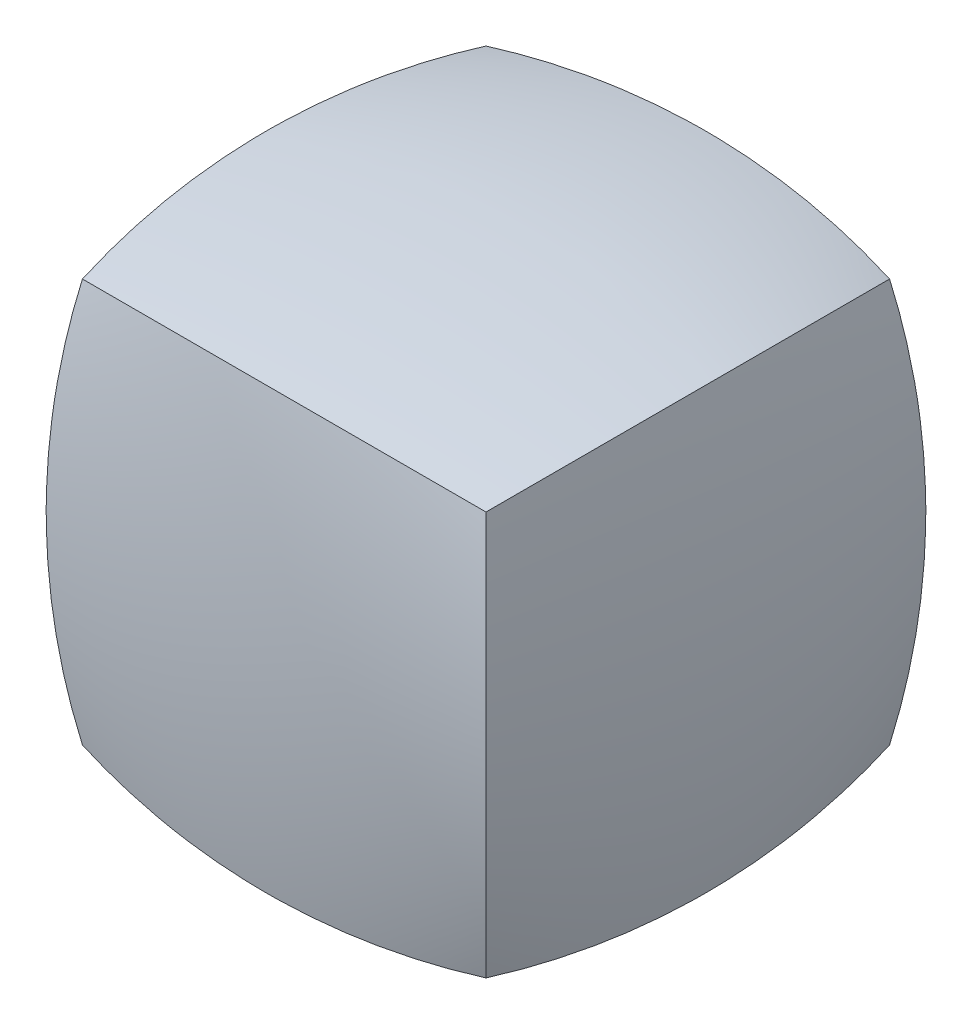
ISO-10303-21;
HEADER;
FILE_DESCRIPTION(('STEP AP214'),'2;1');
FILE_NAME('part.step','',(''),(''),'','','');
FILE_SCHEMA(('AUTOMOTIVE_DESIGN { 1 0 10303 214 1 1 1 1 }'));
ENDSEC;
DATA;
#1=APPLICATION_CONTEXT('core data for automotive mechanical design processes');
#2=APPLICATION_PROTOCOL_DEFINITION('international standard','automotive_design',2000,#1);
#3=PRODUCT_CONTEXT('',#1,'mechanical');
#4=PRODUCT('Part','Part','',(#3));
#5=PRODUCT_RELATED_PRODUCT_CATEGORY('part','',(#4));
#6=PRODUCT_DEFINITION_FORMATION('','',#4);
#7=PRODUCT_DEFINITION_CONTEXT('part definition',#1,'design');
#8=PRODUCT_DEFINITION('design','',#6,#7);
#9=PRODUCT_DEFINITION_SHAPE('','',#8);
#10=(LENGTH_UNIT() NAMED_UNIT(*) SI_UNIT(.MILLI.,.METRE.));
#11=(NAMED_UNIT(*) PLANE_ANGLE_UNIT() SI_UNIT($,.RADIAN.));
#12=(NAMED_UNIT(*) SI_UNIT($,.STERADIAN.) SOLID_ANGLE_UNIT());
#13=UNCERTAINTY_MEASURE_WITH_UNIT(LENGTH_MEASURE(1.E-05),#10,'distance_accuracy_value','');
#14=(GEOMETRIC_REPRESENTATION_CONTEXT(3) GLOBAL_UNCERTAINTY_ASSIGNED_CONTEXT((#13)) GLOBAL_UNIT_ASSIGNED_CONTEXT((#10,
#11,#12)) REPRESENTATION_CONTEXT('',''));
#15=CARTESIAN_POINT('',(0.,0.,0.));
#16=DIRECTION('',(0.,0.,1.));
#17=DIRECTION('',(1.,0.,0.));
#18=AXIS2_PLACEMENT_3D('',#15,#16,#17);
#19=CARTESIAN_POINT('',(12.7000000000001,-12.6999999999999,-12.7));
#20=CARTESIAN_POINT('',(4.37004205779716,-14.2208352893379,-14.220835289338));
#21=CARTESIAN_POINT('',(-4.37004205779696,-14.2208352893379,-14.2208352893381));
#22=CARTESIAN_POINT('',(-12.6999999999999,-12.6999999999999,-12.7000000000001));
#23=CARTESIAN_POINT('',(14.220835289338,-14.220835289338,-4.37004205779701));
#24=CARTESIAN_POINT('',(4.87698715424311,-15.7416705786759,-4.87698715424311));
#25=CARTESIAN_POINT('',(-4.87698715424297,-15.7416705786759,-4.87698715424316));
#26=CARTESIAN_POINT('',(-14.2208352893379,-14.2208352893379,-4.3700420577972));
#27=CARTESIAN_POINT('',(14.2208352893379,-14.220835289338,4.37004205779711));
#28=CARTESIAN_POINT('',(4.87698715424307,-15.741670578676,4.87698715424294));
#29=CARTESIAN_POINT('',(-4.87698715424301,-15.741670578676,4.87698715424291));
#30=CARTESIAN_POINT('',(-14.2208352893379,-14.220835289338,4.37004205779691));
#31=CARTESIAN_POINT('',(12.6999999999998,-12.7000000000001,12.7000000000001));
#32=CARTESIAN_POINT('',(4.37004205779706,-14.2208352893381,14.2208352893378));
#33=CARTESIAN_POINT('',(-4.37004205779705,-14.2208352893381,14.2208352893378));
#34=CARTESIAN_POINT('',(-12.7,-12.7000000000001,12.6999999999999));
#35=B_SPLINE_SURFACE_WITH_KNOTS('',3,3,((#19,#20,#21,#22),(#23,#24,#25,#26),(#27,#28,#29,#30),
(#31,#32,#33,#34)),.UNSPECIFIED.,.F.,.F.,.F.,(4,4),(4,4),(0.,1.),(0.,1.),.UNSPECIFIED.);
#36=CARTESIAN_POINT('',(12.7,-12.7000000000001,12.6999999999999));
#37=CARTESIAN_POINT('',(12.808163142103,-12.8081631421031,12.1075659462186));
#38=CARTESIAN_POINT('',(12.9087486818566,-12.9087486818567,11.5124219256881));
#39=CARTESIAN_POINT('',(13.0946543970654,-13.0946543970655,10.3173885807694));
#40=CARTESIAN_POINT('',(13.1799746742148,-13.1799746742148,9.71749928802119));
#41=CARTESIAN_POINT('',(13.4128119976239,-13.412811997624,7.91219725853617));
#42=CARTESIAN_POINT('',(13.5372926293325,-13.5372926293325,6.70067319721369));
#43=CARTESIAN_POINT('',(13.7240803205732,-13.7240803205732,4.26817611667957));
#44=CARTESIAN_POINT('',(13.7863855916014,-13.7863855916014,3.04720282667438));
#45=CARTESIAN_POINT('',(13.8485223656913,-13.8485223656913,0.601763003725304));
#46=CARTESIAN_POINT('',(13.8483423856396,-13.8483423856396,-0.622704129947835));
#47=CARTESIAN_POINT('',(13.7934098673822,-13.7934098673823,-2.76017821279836));
#48=CARTESIAN_POINT('',(13.7524154945921,-13.7524154945921,-3.67394558271152));
#49=CARTESIAN_POINT('',(13.6355722104236,-13.6355722104236,-5.49716768806743));
#50=CARTESIAN_POINT('',(13.5597188051603,-13.5597188051603,-6.4066218521921));
#51=CARTESIAN_POINT('',(13.3732652826263,-13.3732652826263,-8.21937943516999));
#52=CARTESIAN_POINT('',(13.262627469886,-13.262627469886,-9.12267508995592));
#53=CARTESIAN_POINT('',(13.0069934203018,-13.0069934203018,-10.9193811690343));
#54=CARTESIAN_POINT('',(12.8620011501779,-12.8620011501779,-11.812792722133));
#55=CARTESIAN_POINT('',(12.6999999999999,-12.6999999999999,-12.7000000000001));
#56=B_SPLINE_CURVE_WITH_KNOTS('',3,(#36,#37,#38,#39,#40,#41,#42,#43,#44,#45,#46,#47,#48,#49,#50,
#51,#52,#53,#54,#55),.UNSPECIFIED.,.F.,.F.,(4,2,2,2,2,2,2,2,2,4),(0.,1.83537962622689,
3.67074702506192,7.34000686795346,11.0093722558164,14.6794119749915,17.4249742189888,
20.1708905090602,22.9197928345178,25.668377913908),.UNSPECIFIED.);
#57=CARTESIAN_POINT('',(12.7000000000001,-12.6999999999999,12.7));
#58=VERTEX_POINT('',#57);
#59=CARTESIAN_POINT('',(12.7000000000001,-12.6999999999999,-12.7));
#60=VERTEX_POINT('',#59);
#61=EDGE_CURVE('E126',#58,#60,#56,.T.);
#62=CARTESIAN_POINT('',(12.6999999999998,-12.7000000000001,12.7000000000001));
#63=CARTESIAN_POINT('',(12.1075659462185,-12.8081631421031,12.808163142103));
#64=CARTESIAN_POINT('',(11.512421925688,-12.9087486818568,12.9087486818566));
#65=CARTESIAN_POINT('',(10.3173885807694,-13.0946543970656,13.0946543970653));
#66=CARTESIAN_POINT('',(9.71749928802112,-13.1799746742149,13.1799746742147));
#67=CARTESIAN_POINT('',(7.91219725853611,-13.4128119976241,13.4128119976239));
#68=CARTESIAN_POINT('',(6.70067319721363,-13.5372926293326,13.5372926293325));
#69=CARTESIAN_POINT('',(4.2681761166795,-13.7240803205733,13.7240803205731));
#70=CARTESIAN_POINT('',(3.04720282667431,-13.7863855916015,13.7863855916013));
#71=CARTESIAN_POINT('',(0.601763003725235,-13.8485223656914,13.8485223656912));
#72=CARTESIAN_POINT('',(-0.622704129947903,-13.8483423856397,13.8483423856395));
#73=CARTESIAN_POINT('',(-2.76017821279841,-13.7934098673824,13.7934098673822));
#74=CARTESIAN_POINT('',(-3.67394558271155,-13.7524154945922,13.752415494592));
#75=CARTESIAN_POINT('',(-5.49716768806742,-13.6355722104237,13.6355722104235));
#76=CARTESIAN_POINT('',(-6.40662185219208,-13.5597188051604,13.5597188051602));
#77=CARTESIAN_POINT('',(-8.21937943516994,-13.3732652826265,13.3732652826262));
#78=CARTESIAN_POINT('',(-9.12267508995585,-13.2626274698862,13.2626274698859));
#79=CARTESIAN_POINT('',(-10.9193811690342,-13.006993420302,13.0069934203018));
#80=CARTESIAN_POINT('',(-11.8127927221329,-12.8620011501781,12.8620011501779));
#81=CARTESIAN_POINT('',(-12.7,-12.7000000000001,12.6999999999999));
#82=B_SPLINE_CURVE_WITH_KNOTS('',3,(#62,#63,#64,#65,#66,#67,#68,#69,#70,#71,#72,#73,#74,#75,#76,
#77,#78,#79,#80,#81),.UNSPECIFIED.,.F.,.F.,(4,2,2,2,2,2,2,2,2,4),(0.,1.83537962622689,
3.67074702506192,7.34000686795347,11.0093722558164,14.6794119749915,17.4249742189888,
20.1708905090602,22.9197928345177,25.6683779139079),.UNSPECIFIED.);
#83=CARTESIAN_POINT('',(-12.7,-12.7000000000001,12.6999999999999));
#84=VERTEX_POINT('',#83);
#85=EDGE_CURVE('E116',#58,#84,#82,.T.);
#86=CARTESIAN_POINT('',(-12.7000000000001,-12.7000000000001,-12.6999999999998));
#87=CARTESIAN_POINT('',(-12.8081631421031,-12.8081631421031,-12.1075659462185));
#88=CARTESIAN_POINT('',(-12.9087486818567,-12.9087486818567,-11.512421925688));
#89=CARTESIAN_POINT('',(-13.0946543970655,-13.0946543970655,-10.3173885807694));
#90=CARTESIAN_POINT('',(-13.1799746742148,-13.1799746742148,-9.7174992880211));
#91=CARTESIAN_POINT('',(-13.412811997624,-13.412811997624,-7.91219725853608));
#92=CARTESIAN_POINT('',(-13.5372926293325,-13.5372926293325,-6.7006731972136));
#93=CARTESIAN_POINT('',(-13.7240803205732,-13.7240803205732,-4.26817611667947));
#94=CARTESIAN_POINT('',(-13.7863855916014,-13.7863855916014,-3.04720282667428));
#95=CARTESIAN_POINT('',(-13.8485223656913,-13.8485223656913,-0.601763003725207));
#96=CARTESIAN_POINT('',(-13.8483423856396,-13.8483423856396,0.622704129947932));
#97=CARTESIAN_POINT('',(-13.7934098673822,-13.7934098673823,2.76017821279846));
#98=CARTESIAN_POINT('',(-13.752415494592,-13.7524154945921,3.67394558271161));
#99=CARTESIAN_POINT('',(-13.6355722104235,-13.6355722104236,5.49716768806752));
#100=CARTESIAN_POINT('',(-13.5597188051602,-13.5597188051603,6.40662185219219));
#101=CARTESIAN_POINT('',(-13.3732652826263,-13.3732652826263,8.21937943517008));
#102=CARTESIAN_POINT('',(-13.2626274698859,-13.262627469886,9.12267508995601));
#103=CARTESIAN_POINT('',(-13.0069934203018,-13.0069934203018,10.9193811690344));
#104=CARTESIAN_POINT('',(-12.8620011501779,-12.8620011501779,11.8127927221331));
#105=CARTESIAN_POINT('',(-12.6999999999998,-12.6999999999999,12.7000000000002));
#106=B_SPLINE_CURVE_WITH_KNOTS('',3,(#86,#87,#88,#89,#90,#91,#92,#93,#94,#95,#96,#97,#98,#99,
#100,#101,#102,#103,#104,#105),.UNSPECIFIED.,.F.,.F.,(4,2,2,2,2,2,2,2,2,4),(0.,1.83537962622689,
3.67074702506192,7.34000686795346,11.0093722558164,14.6794119749915,17.4249742189888,
20.1708905090602,22.9197928345178,25.6683779139081),.UNSPECIFIED.);
#107=CARTESIAN_POINT('',(-12.7000000000001,-12.7000000000001,-12.6999999999998));
#108=VERTEX_POINT('',#107);
#109=EDGE_CURVE('E13',#108,#84,#106,.T.);
#110=CARTESIAN_POINT('',(-12.6999999999999,-12.6999999999999,-12.7000000000001));
#111=CARTESIAN_POINT('',(-12.1075659462186,-12.8081631421029,-12.8081631421031));
#112=CARTESIAN_POINT('',(-11.5124219256881,-12.9087486818566,-12.9087486818568));
#113=CARTESIAN_POINT('',(-10.3173885807695,-13.0946543970654,-13.0946543970656));
#114=CARTESIAN_POINT('',(-9.71749928802124,-13.1799746742147,-13.1799746742149));
#115=CARTESIAN_POINT('',(-7.91219725853622,-13.4128119976239,-13.4128119976241));
#116=CARTESIAN_POINT('',(-6.70067319721374,-13.5372926293324,-13.5372926293326));
#117=CARTESIAN_POINT('',(-4.26817611667962,-13.7240803205731,-13.7240803205733));
#118=CARTESIAN_POINT('',(-3.04720282667443,-13.7863855916013,-13.7863855916014));
#119=CARTESIAN_POINT('',(-0.601763003725352,-13.8485223656912,-13.8485223656914));
#120=CARTESIAN_POINT('',(0.622704129947787,-13.8483423856395,-13.8483423856396));
#121=CARTESIAN_POINT('',(2.76017821279831,-13.7934098673822,-13.7934098673823));
#122=CARTESIAN_POINT('',(3.67394558271147,-13.752415494592,-13.7524154945921));
#123=CARTESIAN_POINT('',(5.49716768806738,-13.6355722104236,-13.6355722104237));
#124=CARTESIAN_POINT('',(6.40662185219205,-13.5597188051603,-13.5597188051604));
#125=CARTESIAN_POINT('',(8.21937943516994,-13.3732652826263,-13.3732652826264));
#126=CARTESIAN_POINT('',(9.12267508995587,-13.262627469886,-13.2626274698861));
#127=CARTESIAN_POINT('',(10.9193811690342,-13.0069934203018,-13.0069934203019));
#128=CARTESIAN_POINT('',(11.812792722133,-12.8620011501779,-12.862001150178));
#129=CARTESIAN_POINT('',(12.7000000000001,-12.6999999999999,-12.7));
#130=B_SPLINE_CURVE_WITH_KNOTS('',3,(#110,#111,#112,#113,#114,#115,#116,#117,#118,#119,#120,
#121,#122,#123,#124,#125,#126,#127,#128,#129),.UNSPECIFIED.,.F.,.F.,(4,2,2,2,2,2,2,2,2,4),(0.,
1.83537962622689,3.67074702506192,7.34000686795346,11.0093722558164,14.6794119749915,
17.4249742189888,20.1708905090602,22.9197928345178,25.6683779139081),.UNSPECIFIED.);
#131=EDGE_CURVE('E123',#108,#60,#130,.T.);
#132=ORIENTED_EDGE('',*,*,#61,.F.);
#133=ORIENTED_EDGE('',*,*,#85,.T.);
#134=ORIENTED_EDGE('',*,*,#109,.F.);
#135=ORIENTED_EDGE('',*,*,#131,.T.);
#136=EDGE_LOOP('',(#132,#133,#134,#135));
#137=FACE_BOUND('',#136,.T.);
#138=ADVANCED_FACE('F67',(#137),#35,.T.);
#139=CARTESIAN_POINT('',(12.7000000000001,12.7,12.6999999999999));
#140=CARTESIAN_POINT('',(4.37004205779716,14.220835289338,14.2208352893379));
#141=CARTESIAN_POINT('',(-4.37004205779696,14.220835289338,14.220835289338));
#142=CARTESIAN_POINT('',(-12.6999999999999,12.7,12.7));
#143=CARTESIAN_POINT('',(14.220835289338,14.220835289338,4.37004205779691));
#144=CARTESIAN_POINT('',(4.87698715424311,15.7416705786759,4.876987154243));
#145=CARTESIAN_POINT('',(-4.87698715424297,15.7416705786759,4.87698715424305));
#146=CARTESIAN_POINT('',(-14.2208352893379,14.220835289338,4.3700420577971));
#147=CARTESIAN_POINT('',(14.2208352893379,14.220835289338,-4.37004205779721));
#148=CARTESIAN_POINT('',(4.87698715424307,15.7416705786759,-4.87698715424305));
#149=CARTESIAN_POINT('',(-4.87698715424301,15.7416705786759,-4.87698715424302));
#150=CARTESIAN_POINT('',(-14.2208352893379,14.220835289338,-4.37004205779701));
#151=CARTESIAN_POINT('',(12.6999999999998,12.7,-12.7000000000001));
#152=CARTESIAN_POINT('',(4.37004205779706,14.220835289338,-14.2208352893379));
#153=CARTESIAN_POINT('',(-4.37004205779705,14.220835289338,-14.2208352893379));
#154=CARTESIAN_POINT('',(-12.7,12.7,-12.7));
#155=B_SPLINE_SURFACE_WITH_KNOTS('',3,3,((#139,#140,#141,#142),(#143,#144,#145,#146),(#147,#148,
#149,#150),(#151,#152,#153,#154)),.UNSPECIFIED.,.F.,.F.,.F.,(4,4),(4,4),(0.,1.),(0.,1.),.UNSPECIFIED.);
#156=CARTESIAN_POINT('',(12.7,12.7000000000001,-12.6999999999999));
#157=CARTESIAN_POINT('',(12.808163142103,12.808163142103,-12.1075659462186));
#158=CARTESIAN_POINT('',(12.9087486818567,12.9087486818566,-11.5124219256881));
#159=CARTESIAN_POINT('',(13.0946543970655,13.0946543970654,-10.3173885807694));
#160=CARTESIAN_POINT('',(13.1799746742148,13.1799746742147,-9.71749928802117));
#161=CARTESIAN_POINT('',(13.412811997624,13.4128119976239,-7.91219725853615));
#162=CARTESIAN_POINT('',(13.5372926293325,13.5372926293325,-6.70067319721368));
#163=CARTESIAN_POINT('',(13.7240803205732,13.7240803205732,-4.26817611667955));
#164=CARTESIAN_POINT('',(13.7863855916014,13.7863855916013,-3.04720282667436));
#165=CARTESIAN_POINT('',(13.8485223656914,13.8485223656912,-0.601763003725283));
#166=CARTESIAN_POINT('',(13.8483423856397,13.8483423856395,0.622704129947855));
#167=CARTESIAN_POINT('',(13.7934098673823,13.7934098673822,2.76017821279836));
#168=CARTESIAN_POINT('',(13.7524154945922,13.752415494592,3.6739455827115));
#169=CARTESIAN_POINT('',(13.6355722104237,13.6355722104235,5.49716768806738));
#170=CARTESIAN_POINT('',(13.5597188051604,13.5597188051602,6.40662185219203));
#171=CARTESIAN_POINT('',(13.3732652826265,13.3732652826263,8.21937943516989));
#172=CARTESIAN_POINT('',(13.2626274698862,13.262627469886,9.12267508995581));
#173=CARTESIAN_POINT('',(13.006993420302,13.0069934203018,10.9193811690341));
#174=CARTESIAN_POINT('',(12.8620011501781,12.8620011501779,11.8127927221329));
#175=CARTESIAN_POINT('',(12.7000000000001,12.6999999999999,12.7));
#176=B_SPLINE_CURVE_WITH_KNOTS('',3,(#156,#157,#158,#159,#160,#161,#162,#163,#164,#165,#166,
#167,#168,#169,#170,#171,#172,#173,#174,#175),.UNSPECIFIED.,.F.,.F.,(4,2,2,2,2,2,2,2,2,4),(0.,
1.83537962622689,3.67074702506193,7.34000686795347,11.0093722558164,14.6794119749915,
17.4249742189888,20.1708905090602,22.9197928345177,25.6683779139079),.UNSPECIFIED.);
#177=CARTESIAN_POINT('',(12.7000000000001,12.7,-12.6999999999999));
#178=VERTEX_POINT('',#177);
#179=CARTESIAN_POINT('',(12.6999999999998,12.7000000000001,12.7000000000001));
#180=VERTEX_POINT('',#179);
#181=EDGE_CURVE('E130',#178,#180,#176,.T.);
#182=CARTESIAN_POINT('',(12.6999999999998,12.7,-12.7000000000002));
#183=CARTESIAN_POINT('',(12.1075659462185,12.808163142103,-12.8081631421031));
#184=CARTESIAN_POINT('',(11.512421925688,12.9087486818567,-12.9087486818567));
#185=CARTESIAN_POINT('',(10.3173885807694,13.0946543970655,-13.0946543970654));
#186=CARTESIAN_POINT('',(9.71749928802112,13.1799746742148,-13.1799746742147));
#187=CARTESIAN_POINT('',(7.91219725853611,13.412811997624,-13.412811997624));
#188=CARTESIAN_POINT('',(6.70067319721363,13.5372926293325,-13.5372926293326));
#189=CARTESIAN_POINT('',(4.2681761166795,13.7240803205732,-13.7240803205732));
#190=CARTESIAN_POINT('',(3.04720282667431,13.7863855916014,-13.7863855916014));
#191=CARTESIAN_POINT('',(0.601763003725235,13.8485223656913,-13.8485223656913));
#192=CARTESIAN_POINT('',(-0.622704129947903,13.8483423856396,-13.8483423856396));
#193=CARTESIAN_POINT('',(-2.76017821279841,13.7934098673823,-13.7934098673822));
#194=CARTESIAN_POINT('',(-3.67394558271155,13.7524154945921,-13.7524154945921));
#195=CARTESIAN_POINT('',(-5.49716768806742,13.6355722104236,-13.6355722104236));
#196=CARTESIAN_POINT('',(-6.40662185219208,13.5597188051603,-13.5597188051603));
#197=CARTESIAN_POINT('',(-8.21937943516994,13.3732652826264,-13.3732652826263));
#198=CARTESIAN_POINT('',(-9.12267508995585,13.2626274698861,-13.262627469886));
#199=CARTESIAN_POINT('',(-10.9193811690342,13.0069934203019,-13.0069934203019));
#200=CARTESIAN_POINT('',(-11.8127927221329,12.862001150178,-12.862001150178));
#201=CARTESIAN_POINT('',(-12.7,12.7,-12.6999999999999));
#202=B_SPLINE_CURVE_WITH_KNOTS('',3,(#182,#183,#184,#185,#186,#187,#188,#189,#190,#191,#192,
#193,#194,#195,#196,#197,#198,#199,#200,#201),.UNSPECIFIED.,.F.,.F.,(4,2,2,2,2,2,2,2,2,4),(0.,
1.83537962622689,3.67074702506192,7.34000686795347,11.0093722558164,14.6794119749915,
17.4249742189888,20.1708905090601,22.9197928345177,25.6683779139079),.UNSPECIFIED.);
#203=CARTESIAN_POINT('',(-12.7,12.7,-12.6999999999999));
#204=VERTEX_POINT('',#203);
#205=EDGE_CURVE('E211',#178,#204,#202,.T.);
#206=CARTESIAN_POINT('',(-12.6999999999999,12.7000000000001,12.7));
#207=CARTESIAN_POINT('',(-12.8081631421029,12.808163142103,12.1075659462187));
#208=CARTESIAN_POINT('',(-12.9087486818566,12.9087486818566,11.5124219256882));
#209=CARTESIAN_POINT('',(-13.0946543970654,13.0946543970654,10.3173885807695));
#210=CARTESIAN_POINT('',(-13.1799746742148,13.1799746742147,9.71749928802126));
#211=CARTESIAN_POINT('',(-13.4128119976239,13.4128119976239,7.91219725853624));
#212=CARTESIAN_POINT('',(-13.5372926293325,13.5372926293325,6.70067319721377));
#213=CARTESIAN_POINT('',(-13.7240803205732,13.7240803205732,4.26817611667965));
#214=CARTESIAN_POINT('',(-13.7863855916014,13.7863855916013,3.04720282667446));
#215=CARTESIAN_POINT('',(-13.8485223656914,13.8485223656912,0.601763003725381));
#216=CARTESIAN_POINT('',(-13.8483423856397,13.8483423856395,-0.622704129947757));
#217=CARTESIAN_POINT('',(-13.7934098673824,13.7934098673822,-2.76017821279827));
#218=CARTESIAN_POINT('',(-13.7524154945922,13.752415494592,-3.67394558271141));
#219=CARTESIAN_POINT('',(-13.6355722104237,13.6355722104235,-5.49716768806728));
#220=CARTESIAN_POINT('',(-13.5597188051605,13.5597188051602,-6.40662185219194));
#221=CARTESIAN_POINT('',(-13.3732652826265,13.3732652826263,-8.2193794351698));
#222=CARTESIAN_POINT('',(-13.2626274698862,13.262627469886,-9.12267508995571));
#223=CARTESIAN_POINT('',(-13.0069934203021,13.0069934203018,-10.9193811690341));
#224=CARTESIAN_POINT('',(-12.8620011501782,12.8620011501779,-11.8127927221328));
#225=CARTESIAN_POINT('',(-12.7000000000002,12.6999999999999,-12.6999999999999));
#226=B_SPLINE_CURVE_WITH_KNOTS('',3,(#206,#207,#208,#209,#210,#211,#212,#213,#214,#215,#216,
#217,#218,#219,#220,#221,#222,#223,#224,#225),.UNSPECIFIED.,.F.,.F.,(4,2,2,2,2,2,2,2,2,4),(0.,
1.83537962622689,3.67074702506193,7.34000686795347,11.0093722558164,14.6794119749915,
17.4249742189888,20.1708905090602,22.9197928345177,25.6683779139079),.UNSPECIFIED.);
#227=CARTESIAN_POINT('',(-12.6999999999999,12.7,12.7));
#228=VERTEX_POINT('',#227);
#229=EDGE_CURVE('E191',#228,#204,#226,.T.);
#230=CARTESIAN_POINT('',(-12.6999999999999,12.7,12.7));
#231=CARTESIAN_POINT('',(-12.1075659462186,12.808163142103,12.808163142103));
#232=CARTESIAN_POINT('',(-11.5124219256881,12.9087486818566,12.9087486818567));
#233=CARTESIAN_POINT('',(-10.3173885807695,13.0946543970655,13.0946543970655));
#234=CARTESIAN_POINT('',(-9.71749928802124,13.1799746742148,13.1799746742148));
#235=CARTESIAN_POINT('',(-7.91219725853622,13.412811997624,13.412811997624));
#236=CARTESIAN_POINT('',(-6.70067319721374,13.5372926293325,13.5372926293325));
#237=CARTESIAN_POINT('',(-4.26817611667962,13.7240803205732,13.7240803205732));
#238=CARTESIAN_POINT('',(-3.04720282667443,13.7863855916014,13.7863855916014));
#239=CARTESIAN_POINT('',(-0.601763003725352,13.8485223656913,13.8485223656913));
#240=CARTESIAN_POINT('',(0.622704129947788,13.8483423856396,13.8483423856395));
#241=CARTESIAN_POINT('',(2.76017821279831,13.7934098673823,13.7934098673822));
#242=CARTESIAN_POINT('',(3.67394558271147,13.7524154945921,13.752415494592));
#243=CARTESIAN_POINT('',(5.49716768806738,13.6355722104236,13.6355722104236));
#244=CARTESIAN_POINT('',(6.40662185219205,13.5597188051604,13.5597188051603));
#245=CARTESIAN_POINT('',(8.21937943516994,13.3732652826264,13.3732652826263));
#246=CARTESIAN_POINT('',(9.12267508995587,13.2626274698861,13.262627469886));
#247=CARTESIAN_POINT('',(10.9193811690342,13.0069934203019,13.0069934203018));
#248=CARTESIAN_POINT('',(11.812792722133,12.862001150178,12.8620011501779));
#249=CARTESIAN_POINT('',(12.7000000000001,12.7,12.6999999999999));
#250=B_SPLINE_CURVE_WITH_KNOTS('',3,(#230,#231,#232,#233,#234,#235,#236,#237,#238,#239,#240,
#241,#242,#243,#244,#245,#246,#247,#248,#249),.UNSPECIFIED.,.F.,.F.,(4,2,2,2,2,2,2,2,2,4),(0.,
1.83537962622689,3.67074702506192,7.34000686795346,11.0093722558164,14.6794119749915,
17.4249742189888,20.1708905090602,22.9197928345178,25.6683779139081),.UNSPECIFIED.);
#251=EDGE_CURVE('E124',#228,#180,#250,.T.);
#252=ORIENTED_EDGE('',*,*,#181,.F.);
#253=ORIENTED_EDGE('',*,*,#205,.T.);
#254=ORIENTED_EDGE('',*,*,#229,.F.);
#255=ORIENTED_EDGE('',*,*,#251,.T.);
#256=EDGE_LOOP('',(#252,#253,#254,#255));
#257=FACE_BOUND('',#256,.T.);
#258=ADVANCED_FACE('F235',(#257),#155,.T.);
#259=CARTESIAN_POINT('',(12.7000000000001,-12.6999999999999,12.7));
#260=CARTESIAN_POINT('',(4.37004205779716,-14.2208352893379,14.2208352893379));
#261=CARTESIAN_POINT('',(-4.37004205779696,-14.220835289338,14.2208352893379));
#262=CARTESIAN_POINT('',(-12.6999999999999,-12.7000000000001,12.7));
#263=CARTESIAN_POINT('',(14.220835289338,-4.37004205779696,14.220835289338));
#264=CARTESIAN_POINT('',(4.87698715424311,-4.87698715424306,15.7416705786759));
#265=CARTESIAN_POINT('',(-4.87698715424297,-4.87698715424311,15.7416705786759));
#266=CARTESIAN_POINT('',(-14.2208352893379,-4.37004205779715,14.220835289338));
#267=CARTESIAN_POINT('',(14.2208352893379,4.37004205779716,14.220835289338));
#268=CARTESIAN_POINT('',(4.87698715424307,4.87698715424299,15.741670578676));
#269=CARTESIAN_POINT('',(-4.87698715424301,4.87698715424297,15.741670578676));
#270=CARTESIAN_POINT('',(-14.2208352893379,4.37004205779696,14.220835289338));
#271=CARTESIAN_POINT('',(12.6999999999998,12.7000000000001,12.7000000000001));
#272=CARTESIAN_POINT('',(4.37004205779706,14.2208352893379,14.220835289338));
#273=CARTESIAN_POINT('',(-4.37004205779705,14.2208352893379,14.220835289338));
#274=CARTESIAN_POINT('',(-12.7,12.6999999999999,12.7000000000001));
#275=B_SPLINE_SURFACE_WITH_KNOTS('',3,3,((#259,#260,#261,#262),(#263,#264,#265,#266),(#267,#268,
#269,#270),(#271,#272,#273,#274)),.UNSPECIFIED.,.F.,.F.,.F.,(4,4),(4,4),(0.,1.),(0.,1.),.UNSPECIFIED.);
#276=CARTESIAN_POINT('',(12.7000000000001,12.6999999999999,12.7));
#277=CARTESIAN_POINT('',(12.8081631421031,12.1075659462186,12.808163142103));
#278=CARTESIAN_POINT('',(12.9087486818567,11.5124219256881,12.9087486818566));
#279=CARTESIAN_POINT('',(13.0946543970655,10.3173885807695,13.0946543970654));
#280=CARTESIAN_POINT('',(13.1799746742149,9.71749928802122,13.1799746742147));
#281=CARTESIAN_POINT('',(13.412811997624,7.9121972585362,13.4128119976239));
#282=CARTESIAN_POINT('',(13.5372926293326,6.70067319721372,13.5372926293324));
#283=CARTESIAN_POINT('',(13.7240803205733,4.26817611667959,13.7240803205731));
#284=CARTESIAN_POINT('',(13.7863855916015,3.04720282667441,13.7863855916013));
#285=CARTESIAN_POINT('',(13.8485223656914,0.601763003725328,13.8485223656912));
#286=CARTESIAN_POINT('',(13.8483423856396,-0.62270412994781,13.8483423856395));
#287=CARTESIAN_POINT('',(13.7934098673823,-2.76017821279833,13.7934098673822));
#288=CARTESIAN_POINT('',(13.7524154945922,-3.67394558271148,13.752415494592));
#289=CARTESIAN_POINT('',(13.6355722104237,-5.49716768806738,13.6355722104235));
#290=CARTESIAN_POINT('',(13.5597188051604,-6.40662185219205,13.5597188051602));
#291=CARTESIAN_POINT('',(13.3732652826264,-8.21937943516994,13.3732652826263));
#292=CARTESIAN_POINT('',(13.2626274698861,-9.12267508995586,13.262627469886));
#293=CARTESIAN_POINT('',(13.0069934203019,-10.9193811690342,13.0069934203018));
#294=CARTESIAN_POINT('',(12.862001150178,-11.812792722133,12.8620011501779));
#295=CARTESIAN_POINT('',(12.7,-12.7000000000001,12.6999999999999));
#296=B_SPLINE_CURVE_WITH_KNOTS('',3,(#276,#277,#278,#279,#280,#281,#282,#283,#284,#285,#286,
#287,#288,#289,#290,#291,#292,#293,#294,#295),.UNSPECIFIED.,.F.,.F.,(4,2,2,2,2,2,2,2,2,4),(0.,
1.83537962622688,3.67074702506192,7.34000686795346,11.0093722558164,14.6794119749915,
17.4249742189888,20.1708905090602,22.9197928345178,25.668377913908),.UNSPECIFIED.);
#297=EDGE_CURVE('E120',#180,#58,#296,.T.);
#298=CARTESIAN_POINT('',(-12.6999999999998,-12.6999999999999,12.7000000000002));
#299=CARTESIAN_POINT('',(-12.8081631421028,-12.1075659462186,12.8081631421032));
#300=CARTESIAN_POINT('',(-12.9087486818565,-11.5124219256881,12.9087486818568));
#301=CARTESIAN_POINT('',(-13.0946543970653,-10.3173885807695,13.0946543970656));
#302=CARTESIAN_POINT('',(-13.1799746742146,-9.71749928802123,13.179974674215));
#303=CARTESIAN_POINT('',(-13.4128119976238,-7.91219725853621,13.4128119976241));
#304=CARTESIAN_POINT('',(-13.5372926293323,-6.70067319721373,13.5372926293326));
#305=CARTESIAN_POINT('',(-13.724080320573,-4.2681761166796,13.7240803205733));
#306=CARTESIAN_POINT('',(-13.7863855916012,-3.04720282667442,13.7863855916015));
#307=CARTESIAN_POINT('',(-13.8485223656912,-0.60176300372534,13.8485223656914));
#308=CARTESIAN_POINT('',(-13.8483423856395,0.622704129947799,13.8483423856397));
#309=CARTESIAN_POINT('',(-13.7934098673822,2.76017821279832,13.7934098673823));
#310=CARTESIAN_POINT('',(-13.752415494592,3.67394558271148,13.7524154945922));
#311=CARTESIAN_POINT('',(-13.6355722104235,5.49716768806738,13.6355722104237));
#312=CARTESIAN_POINT('',(-13.5597188051602,6.40662185219205,13.5597188051604));
#313=CARTESIAN_POINT('',(-13.3732652826263,8.21937943516994,13.3732652826264));
#314=CARTESIAN_POINT('',(-13.262627469886,9.12267508995587,13.2626274698861));
#315=CARTESIAN_POINT('',(-13.0069934203018,10.9193811690342,13.0069934203019));
#316=CARTESIAN_POINT('',(-12.8620011501779,11.812792722133,12.862001150178));
#317=CARTESIAN_POINT('',(-12.6999999999999,12.7000000000001,12.7));
#318=B_SPLINE_CURVE_WITH_KNOTS('',3,(#298,#299,#300,#301,#302,#303,#304,#305,#306,#307,#308,
#309,#310,#311,#312,#313,#314,#315,#316,#317),.UNSPECIFIED.,.F.,.F.,(4,2,2,2,2,2,2,2,2,4),(0.,
1.83537962622689,3.67074702506192,7.34000686795346,11.0093722558164,14.6794119749915,
17.4249742189888,20.1708905090602,22.9197928345178,25.668377913908),.UNSPECIFIED.);
#319=EDGE_CURVE('E83',#84,#228,#318,.T.);
#320=ORIENTED_EDGE('',*,*,#297,.F.);
#321=ORIENTED_EDGE('',*,*,#251,.F.);
#322=ORIENTED_EDGE('',*,*,#319,.F.);
#323=ORIENTED_EDGE('',*,*,#85,.F.);
#324=EDGE_LOOP('',(#320,#321,#322,#323));
#325=FACE_BOUND('',#324,.T.);
#326=ADVANCED_FACE('F118',(#325),#275,.T.);
#327=CARTESIAN_POINT('',(12.6999999999999,-12.6999999999999,-12.7000000000001));
#328=CARTESIAN_POINT('',(14.2208352893379,-14.2208352893379,-4.37004205779721));
#329=CARTESIAN_POINT('',(14.220835289338,-14.220835289338,4.37004205779691));
#330=CARTESIAN_POINT('',(12.7,-12.7000000000001,12.6999999999999));
#331=CARTESIAN_POINT('',(14.2208352893379,-4.37004205779696,-14.220835289338));
#332=CARTESIAN_POINT('',(15.7416705786759,-4.87698715424306,-4.87698715424316));
#333=CARTESIAN_POINT('',(15.7416705786759,-4.87698715424311,4.87698715424292));
#334=CARTESIAN_POINT('',(14.220835289338,-4.37004205779715,14.2208352893379));
#335=CARTESIAN_POINT('',(14.2208352893379,4.37004205779716,-14.2208352893379));
#336=CARTESIAN_POINT('',(15.7416705786759,4.87698715424299,-4.87698715424313));
#337=CARTESIAN_POINT('',(15.741670578676,4.87698715424297,4.87698715424295));
#338=CARTESIAN_POINT('',(14.220835289338,4.37004205779696,14.2208352893379));
#339=CARTESIAN_POINT('',(12.7,12.7000000000001,-12.6999999999999));
#340=CARTESIAN_POINT('',(14.220835289338,14.2208352893379,-4.37004205779711));
#341=CARTESIAN_POINT('',(14.220835289338,14.2208352893379,4.37004205779701));
#342=CARTESIAN_POINT('',(12.7000000000001,12.6999999999999,12.7));
#343=B_SPLINE_SURFACE_WITH_KNOTS('',3,3,((#327,#328,#329,#330),(#331,#332,#333,#334),(#335,#336,
#337,#338),(#339,#340,#341,#342)),.UNSPECIFIED.,.F.,.F.,.F.,(4,4),(4,4),(0.,1.),(0.,1.),.UNSPECIFIED.);
#344=CARTESIAN_POINT('',(12.6999999999999,-12.6999999999999,-12.7000000000001));
#345=CARTESIAN_POINT('',(12.8081631421029,-12.1075659462186,-12.8081631421031));
#346=CARTESIAN_POINT('',(12.9087486818566,-11.5124219256881,-12.9087486818568));
#347=CARTESIAN_POINT('',(13.0946543970654,-10.3173885807695,-13.0946543970655));
#348=CARTESIAN_POINT('',(13.1799746742147,-9.71749928802122,-13.1799746742149));
#349=CARTESIAN_POINT('',(13.4128119976239,-7.91219725853621,-13.412811997624));
#350=CARTESIAN_POINT('',(13.5372926293324,-6.70067319721373,-13.5372926293326));
#351=CARTESIAN_POINT('',(13.7240803205731,-4.2681761166796,-13.7240803205732));
#352=CARTESIAN_POINT('',(13.7863855916013,-3.04720282667442,-13.7863855916014));
#353=CARTESIAN_POINT('',(13.8485223656913,-0.60176300372534,-13.8485223656913));
#354=CARTESIAN_POINT('',(13.8483423856396,0.622704129947798,-13.8483423856396));
#355=CARTESIAN_POINT('',(13.7934098673823,2.76017821279832,-13.7934098673823));
#356=CARTESIAN_POINT('',(13.7524154945921,3.67394558271148,-13.7524154945921));
#357=CARTESIAN_POINT('',(13.6355722104236,5.49716768806738,-13.6355722104236));
#358=CARTESIAN_POINT('',(13.5597188051603,6.40662185219205,-13.5597188051603));
#359=CARTESIAN_POINT('',(13.3732652826264,8.21937943516994,-13.3732652826263));
#360=CARTESIAN_POINT('',(13.2626274698861,9.12267508995587,-13.262627469886));
#361=CARTESIAN_POINT('',(13.0069934203019,10.9193811690342,-13.0069934203018));
#362=CARTESIAN_POINT('',(12.862001150178,11.812792722133,-12.8620011501779));
#363=CARTESIAN_POINT('',(12.7,12.7000000000001,-12.6999999999999));
#364=B_SPLINE_CURVE_WITH_KNOTS('',3,(#344,#345,#346,#347,#348,#349,#350,#351,#352,#353,#354,
#355,#356,#357,#358,#359,#360,#361,#362,#363),.UNSPECIFIED.,.F.,.F.,(4,2,2,2,2,2,2,2,2,4),(0.,
1.83537962622689,3.67074702506192,7.34000686795346,11.0093722558164,14.6794119749915,
17.4249742189888,20.1708905090602,22.9197928345178,25.668377913908),.UNSPECIFIED.);
#365=EDGE_CURVE('E91',#60,#178,#364,.T.);
#366=ORIENTED_EDGE('',*,*,#365,.T.);
#367=ORIENTED_EDGE('',*,*,#181,.T.);
#368=ORIENTED_EDGE('',*,*,#297,.T.);
#369=ORIENTED_EDGE('',*,*,#61,.T.);
#370=EDGE_LOOP('',(#366,#367,#368,#369));
#371=FACE_BOUND('',#370,.T.);
#372=ADVANCED_FACE('F129',(#371),#343,.T.);
#373=CARTESIAN_POINT('',(-12.6999999999998,-12.6999999999999,12.7000000000002));
#374=CARTESIAN_POINT('',(-14.2208352893379,-14.2208352893379,4.3700420577973));
#375=CARTESIAN_POINT('',(-14.220835289338,-14.220835289338,-4.37004205779681));
#376=CARTESIAN_POINT('',(-12.7000000000001,-12.7000000000001,-12.6999999999998));
#377=CARTESIAN_POINT('',(-14.2208352893378,-4.37004205779696,14.2208352893381));
#378=CARTESIAN_POINT('',(-15.7416705786759,-4.87698715424306,4.87698715424327));
#379=CARTESIAN_POINT('',(-15.741670578676,-4.87698715424311,-4.87698715424281));
#380=CARTESIAN_POINT('',(-14.2208352893381,-4.37004205779715,-14.2208352893378));
#381=CARTESIAN_POINT('',(-14.2208352893378,4.37004205779716,14.220835289338));
#382=CARTESIAN_POINT('',(-15.7416705786759,4.87698715424299,4.87698715424324));
#383=CARTESIAN_POINT('',(-15.741670578676,4.87698715424297,-4.87698715424284));
#384=CARTESIAN_POINT('',(-14.2208352893381,4.37004205779696,-14.2208352893378));
#385=CARTESIAN_POINT('',(-12.6999999999999,12.7000000000001,12.7));
#386=CARTESIAN_POINT('',(-14.220835289338,14.2208352893379,4.37004205779721));
#387=CARTESIAN_POINT('',(-14.2208352893381,14.2208352893379,-4.37004205779691));
#388=CARTESIAN_POINT('',(-12.7000000000002,12.6999999999999,-12.6999999999999));
#389=B_SPLINE_SURFACE_WITH_KNOTS('',3,3,((#373,#374,#375,#376),(#377,#378,#379,#380),(#381,#382,
#383,#384),(#385,#386,#387,#388)),.UNSPECIFIED.,.F.,.F.,.F.,(4,4),(4,4),(0.,1.),(0.,1.),.UNSPECIFIED.);
#390=CARTESIAN_POINT('',(-12.7000000000002,12.6999999999999,-12.6999999999999));
#391=CARTESIAN_POINT('',(-12.8081631421032,12.1075659462186,-12.8081631421029));
#392=CARTESIAN_POINT('',(-12.9087486818568,11.5124219256881,-12.9087486818565));
#393=CARTESIAN_POINT('',(-13.0946543970656,10.3173885807695,-13.0946543970653));
#394=CARTESIAN_POINT('',(-13.179974674215,9.71749928802122,-13.1799746742146));
#395=CARTESIAN_POINT('',(-13.4128119976241,7.9121972585362,-13.4128119976238));
#396=CARTESIAN_POINT('',(-13.5372926293327,6.70067319721372,-13.5372926293323));
#397=CARTESIAN_POINT('',(-13.7240803205733,4.26817611667959,-13.724080320573));
#398=CARTESIAN_POINT('',(-13.7863855916015,3.04720282667441,-13.7863855916012));
#399=CARTESIAN_POINT('',(-13.8485223656915,0.601763003725328,-13.8485223656911));
#400=CARTESIAN_POINT('',(-13.8483423856397,-0.62270412994781,-13.8483423856394));
#401=CARTESIAN_POINT('',(-13.7934098673824,-2.76017821279833,-13.7934098673821));
#402=CARTESIAN_POINT('',(-13.7524154945923,-3.67394558271148,-13.7524154945919));
#403=CARTESIAN_POINT('',(-13.6355722104238,-5.49716768806738,-13.6355722104234));
#404=CARTESIAN_POINT('',(-13.5597188051605,-6.40662185219205,-13.5597188051601));
#405=CARTESIAN_POINT('',(-13.3732652826265,-8.21937943516994,-13.3732652826262));
#406=CARTESIAN_POINT('',(-13.2626274698862,-9.12267508995586,-13.2626274698859));
#407=CARTESIAN_POINT('',(-13.006993420302,-10.9193811690342,-13.0069934203017));
#408=CARTESIAN_POINT('',(-12.8620011501781,-11.812792722133,-12.8620011501778));
#409=CARTESIAN_POINT('',(-12.7000000000001,-12.7000000000001,-12.6999999999998));
#410=B_SPLINE_CURVE_WITH_KNOTS('',3,(#390,#391,#392,#393,#394,#395,#396,#397,#398,#399,#400,
#401,#402,#403,#404,#405,#406,#407,#408,#409),.UNSPECIFIED.,.F.,.F.,(4,2,2,2,2,2,2,2,2,4),(0.,
1.83537962622689,3.67074702506192,7.34000686795346,11.0093722558164,14.6794119749915,
17.4249742189888,20.1708905090602,22.9197928345178,25.668377913908),.UNSPECIFIED.);
#411=EDGE_CURVE('E73',#204,#108,#410,.T.);
#412=ORIENTED_EDGE('',*,*,#319,.T.);
#413=ORIENTED_EDGE('',*,*,#229,.T.);
#414=ORIENTED_EDGE('',*,*,#411,.T.);
#415=ORIENTED_EDGE('',*,*,#109,.T.);
#416=EDGE_LOOP('',(#412,#413,#414,#415));
#417=FACE_BOUND('',#416,.T.);
#418=ADVANCED_FACE('F157',(#417),#389,.T.);
#419=CARTESIAN_POINT('',(12.7000000000001,12.7,-12.6999999999999));
#420=CARTESIAN_POINT('',(4.37004205779716,14.220835289338,-14.2208352893378));
#421=CARTESIAN_POINT('',(-4.37004205779696,14.2208352893381,-14.2208352893378));
#422=CARTESIAN_POINT('',(-12.6999999999999,12.7000000000002,-12.6999999999999));
#423=CARTESIAN_POINT('',(14.220835289338,4.37004205779706,-14.2208352893379));
#424=CARTESIAN_POINT('',(4.87698715424311,4.87698715424317,-15.7416705786759));
#425=CARTESIAN_POINT('',(-4.87698715424297,4.87698715424322,-15.7416705786759));
#426=CARTESIAN_POINT('',(-14.2208352893379,4.37004205779725,-14.2208352893379));
#427=CARTESIAN_POINT('',(14.2208352893379,-4.37004205779706,-14.220835289338));
#428=CARTESIAN_POINT('',(4.87698715424307,-4.87698715424288,-15.741670578676));
#429=CARTESIAN_POINT('',(-4.87698715424301,-4.87698715424286,-15.741670578676));
#430=CARTESIAN_POINT('',(-14.2208352893379,-4.37004205779686,-14.220835289338));
#431=CARTESIAN_POINT('',(12.6999999999998,-12.7,-12.7000000000002));
#432=CARTESIAN_POINT('',(4.37004205779706,-14.2208352893378,-14.2208352893381));
#433=CARTESIAN_POINT('',(-4.37004205779705,-14.2208352893378,-14.2208352893381));
#434=CARTESIAN_POINT('',(-12.7,-12.6999999999998,-12.7000000000002));
#435=B_SPLINE_SURFACE_WITH_KNOTS('',3,3,((#419,#420,#421,#422),(#423,#424,#425,#426),(#427,#428,
#429,#430),(#431,#432,#433,#434)),.UNSPECIFIED.,.F.,.F.,.F.,(4,4),(4,4),(0.,1.),(0.,1.),.UNSPECIFIED.);
#436=ORIENTED_EDGE('',*,*,#365,.F.);
#437=ORIENTED_EDGE('',*,*,#131,.F.);
#438=ORIENTED_EDGE('',*,*,#411,.F.);
#439=ORIENTED_EDGE('',*,*,#205,.F.);
#440=EDGE_LOOP('',(#436,#437,#438,#439));
#441=FACE_BOUND('',#440,.T.);
#442=ADVANCED_FACE('F69',(#441),#435,.T.);
#443=CLOSED_SHELL('',(#138,#258,#326,#372,#418,#442));
#444=MANIFOLD_SOLID_BREP('B2',#443);
#445=ADVANCED_BREP_SHAPE_REPRESENTATION('',(#18,#444),#14);
#446=SHAPE_DEFINITION_REPRESENTATION(#9,#445);
ENDSEC;
END-ISO-10303-21;
